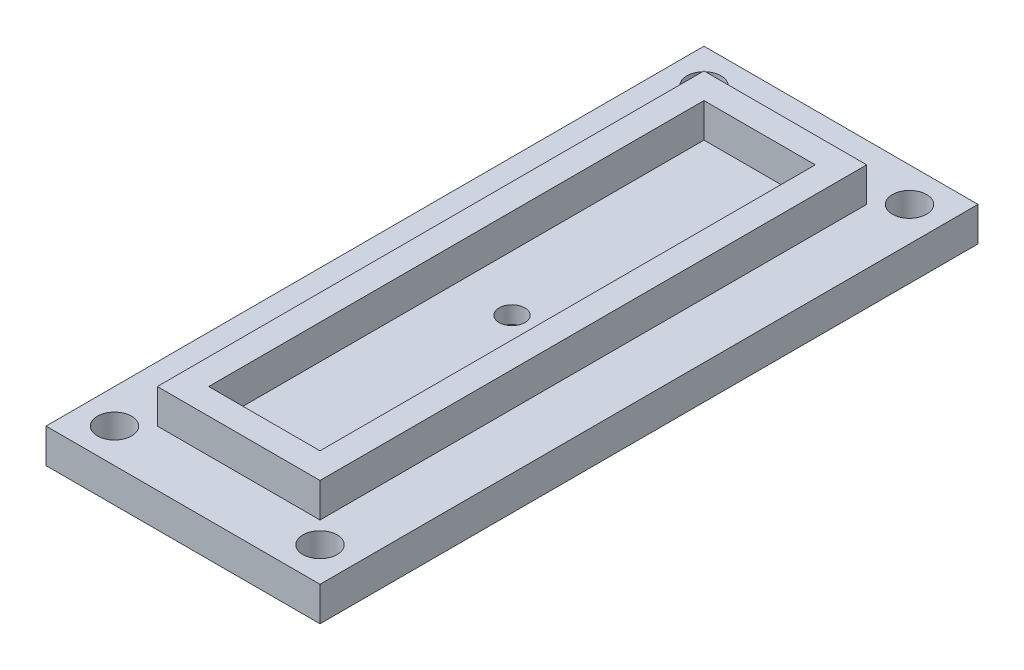
ISO-10303-21;
HEADER;
FILE_DESCRIPTION(('STEP AP214'),'2;1');
FILE_NAME('part.step','',(''),(''),'','','');
FILE_SCHEMA(('AUTOMOTIVE_DESIGN { 1 0 10303 214 1 1 1 1 }'));
ENDSEC;
DATA;
#1=APPLICATION_CONTEXT('core data for automotive mechanical design processes');
#2=APPLICATION_PROTOCOL_DEFINITION('international standard','automotive_design',2000,#1);
#3=PRODUCT_CONTEXT('',#1,'mechanical');
#4=PRODUCT('Part','Part','',(#3));
#5=PRODUCT_RELATED_PRODUCT_CATEGORY('part','',(#4));
#6=PRODUCT_DEFINITION_FORMATION('','',#4);
#7=PRODUCT_DEFINITION_CONTEXT('part definition',#1,'design');
#8=PRODUCT_DEFINITION('design','',#6,#7);
#9=PRODUCT_DEFINITION_SHAPE('','',#8);
#10=(LENGTH_UNIT() NAMED_UNIT(*) SI_UNIT(.MILLI.,.METRE.));
#11=(NAMED_UNIT(*) PLANE_ANGLE_UNIT() SI_UNIT($,.RADIAN.));
#12=(NAMED_UNIT(*) SI_UNIT($,.STERADIAN.) SOLID_ANGLE_UNIT());
#13=UNCERTAINTY_MEASURE_WITH_UNIT(LENGTH_MEASURE(1.E-05),#10,'distance_accuracy_value','');
#14=(GEOMETRIC_REPRESENTATION_CONTEXT(3) GLOBAL_UNCERTAINTY_ASSIGNED_CONTEXT((#13)) GLOBAL_UNIT_ASSIGNED_CONTEXT((#10,
#11,#12)) REPRESENTATION_CONTEXT('',''));
#15=CARTESIAN_POINT('',(0.,0.,0.));
#16=DIRECTION('',(0.,0.,1.));
#17=DIRECTION('',(1.,0.,0.));
#18=AXIS2_PLACEMENT_3D('',#15,#16,#17);
#19=CARTESIAN_POINT('',(0.,0.,0.));
#20=DIRECTION('',(0.,1.,0.));
#21=DIRECTION('',(0.,0.,1.));
#22=AXIS2_PLACEMENT_3D('',#19,#20,#21);
#23=CYLINDRICAL_SURFACE('',#22,0.75);
#24=CARTESIAN_POINT('',(0.,2.,0.));
#25=DIRECTION('',(0.,-1.,0.));
#26=DIRECTION('',(0.,0.,-1.));
#27=AXIS2_PLACEMENT_3D('',#24,#25,#26);
#28=CIRCLE('',#27,0.75);
#29=CARTESIAN_POINT('',(0.,2.,-0.75));
#30=VERTEX_POINT('',#29);
#31=EDGE_CURVE('E543',#30,#30,#28,.T.);
#32=ORIENTED_EDGE('',*,*,#31,.F.);
#33=EDGE_LOOP('',(#32));
#34=FACE_BOUND('',#33,.T.);
#35=CARTESIAN_POINT('',(0.,1.,0.));
#36=DIRECTION('',(0.,-1.,0.));
#37=DIRECTION('',(0.,0.,-1.));
#38=AXIS2_PLACEMENT_3D('',#35,#36,#37);
#39=CIRCLE('',#38,0.75);
#40=CARTESIAN_POINT('',(0.,1.,-0.75));
#41=VERTEX_POINT('',#40);
#42=EDGE_CURVE('E85',#41,#41,#39,.F.);
#43=ORIENTED_EDGE('',*,*,#42,.F.);
#44=EDGE_LOOP('',(#43));
#45=FACE_BOUND('',#44,.T.);
#46=ADVANCED_FACE('F81',(#34,#45),#23,.F.);
#47=CARTESIAN_POINT('',(0.,2.,0.));
#48=DIRECTION('',(0.,-1.,0.));
#49=DIRECTION('',(0.,0.,-1.));
#50=AXIS2_PLACEMENT_3D('',#47,#48,#49);
#51=PLANE('',#50);
#52=CARTESIAN_POINT('',(6.00000000000001,2.,-17.21));
#53=DIRECTION('',(0.,-1.,0.));
#54=DIRECTION('',(0.,0.,-1.));
#55=AXIS2_PLACEMENT_3D('',#52,#53,#54);
#56=CIRCLE('',#55,0.999999999999998);
#57=CARTESIAN_POINT('',(6.00000000000001,2.,-18.21));
#58=VERTEX_POINT('',#57);
#59=EDGE_CURVE('E282',#58,#58,#56,.F.);
#60=ORIENTED_EDGE('',*,*,#59,.F.);
#61=EDGE_LOOP('',(#60));
#62=FACE_BOUND('',#61,.T.);
#63=CARTESIAN_POINT('',(5.99999999999999,2.,17.21));
#64=DIRECTION('',(0.,-1.,0.));
#65=DIRECTION('',(0.,0.,-1.));
#66=AXIS2_PLACEMENT_3D('',#63,#64,#65);
#67=CIRCLE('',#66,0.999999999999998);
#68=CARTESIAN_POINT('',(5.99999999999999,2.,16.21));
#69=VERTEX_POINT('',#68);
#70=EDGE_CURVE('E288',#69,#69,#67,.T.);
#71=ORIENTED_EDGE('',*,*,#70,.T.);
#72=EDGE_LOOP('',(#71));
#73=FACE_BOUND('',#72,.T.);
#74=DIRECTION('',(0.,0.,-1.));
#75=VECTOR('',#74,1.);
#76=CARTESIAN_POINT('',(7.99999999999999,2.,19.21));
#77=LINE('',#76,#75);
#78=CARTESIAN_POINT('',(7.99999999999999,2.,19.21));
#79=VERTEX_POINT('',#78);
#80=CARTESIAN_POINT('',(7.99999999999999,2.,-19.21));
#81=VERTEX_POINT('',#80);
#82=EDGE_CURVE('E355',#79,#81,#77,.T.);
#83=ORIENTED_EDGE('',*,*,#82,.T.);
#84=DIRECTION('',(-1.,0.,0.));
#85=VECTOR('',#84,1.);
#86=CARTESIAN_POINT('',(-8.,2.,-19.21));
#87=LINE('',#86,#85);
#88=CARTESIAN_POINT('',(-8.,2.,-19.21));
#89=VERTEX_POINT('',#88);
#90=EDGE_CURVE('E358',#81,#89,#87,.T.);
#91=ORIENTED_EDGE('',*,*,#90,.T.);
#92=DIRECTION('',(0.,0.,1.));
#93=VECTOR('',#92,1.);
#94=CARTESIAN_POINT('',(-8.,2.,19.21));
#95=LINE('',#94,#93);
#96=CARTESIAN_POINT('',(-8.,2.,19.21));
#97=VERTEX_POINT('',#96);
#98=EDGE_CURVE('E361',#89,#97,#95,.T.);
#99=ORIENTED_EDGE('',*,*,#98,.T.);
#100=DIRECTION('',(1.,0.,0.));
#101=VECTOR('',#100,1.);
#102=CARTESIAN_POINT('',(-8.,2.,19.21));
#103=LINE('',#102,#101);
#104=EDGE_CURVE('E363',#97,#79,#103,.T.);
#105=ORIENTED_EDGE('',*,*,#104,.T.);
#106=EDGE_LOOP('',(#83,#91,#99,#105));
#107=FACE_BOUND('',#106,.T.);
#108=DIRECTION('',(0.,0.,-1.));
#109=VECTOR('',#108,1.);
#110=CARTESIAN_POINT('',(4.75,2.,0.));
#111=LINE('',#110,#109);
#112=CARTESIAN_POINT('',(4.75,2.,15.96));
#113=VERTEX_POINT('',#112);
#114=CARTESIAN_POINT('',(4.75,2.,-15.96));
#115=VERTEX_POINT('',#114);
#116=EDGE_CURVE('E321',#113,#115,#111,.T.);
#117=ORIENTED_EDGE('',*,*,#116,.F.);
#118=DIRECTION('',(1.,0.,0.));
#119=VECTOR('',#118,1.);
#120=CARTESIAN_POINT('',(0.,2.,15.96));
#121=LINE('',#120,#119);
#122=CARTESIAN_POINT('',(-4.75,2.,15.96));
#123=VERTEX_POINT('',#122);
#124=EDGE_CURVE('E326',#123,#113,#121,.T.);
#125=ORIENTED_EDGE('',*,*,#124,.F.);
#126=DIRECTION('',(0.,0.,1.));
#127=VECTOR('',#126,1.);
#128=CARTESIAN_POINT('',(-4.75,2.,0.));
#129=LINE('',#128,#127);
#130=CARTESIAN_POINT('',(-4.75,2.,-15.96));
#131=VERTEX_POINT('',#130);
#132=EDGE_CURVE('E338',#131,#123,#129,.T.);
#133=ORIENTED_EDGE('',*,*,#132,.F.);
#134=DIRECTION('',(-1.,0.,0.));
#135=VECTOR('',#134,1.);
#136=CARTESIAN_POINT('',(0.,2.,-15.96));
#137=LINE('',#136,#135);
#138=EDGE_CURVE('E335',#115,#131,#137,.T.);
#139=ORIENTED_EDGE('',*,*,#138,.F.);
#140=EDGE_LOOP('',(#117,#125,#133,#139));
#141=FACE_BOUND('',#140,.T.);
#142=CARTESIAN_POINT('',(-6.00000000000001,2.,-17.21));
#143=DIRECTION('',(0.,-1.,0.));
#144=DIRECTION('',(0.,0.,-1.));
#145=AXIS2_PLACEMENT_3D('',#142,#143,#144);
#146=CIRCLE('',#145,0.999999999999998);
#147=CARTESIAN_POINT('',(-6.00000000000001,2.,-18.21));
#148=VERTEX_POINT('',#147);
#149=EDGE_CURVE('E276',#148,#148,#146,.T.);
#150=ORIENTED_EDGE('',*,*,#149,.T.);
#151=EDGE_LOOP('',(#150));
#152=FACE_BOUND('',#151,.T.);
#153=CARTESIAN_POINT('',(-5.99999999999999,2.,17.21));
#154=DIRECTION('',(0.,-1.,0.));
#155=DIRECTION('',(0.,0.,-1.));
#156=AXIS2_PLACEMENT_3D('',#153,#154,#155);
#157=CIRCLE('',#156,0.999999999999998);
#158=CARTESIAN_POINT('',(-5.99999999999999,2.,16.21));
#159=VERTEX_POINT('',#158);
#160=EDGE_CURVE('E270',#159,#159,#157,.F.);
#161=ORIENTED_EDGE('',*,*,#160,.F.);
#162=EDGE_LOOP('',(#161));
#163=FACE_BOUND('',#162,.T.);
#164=ADVANCED_FACE('F431',(#62,#73,#107,#141,#152,#163),#51,.F.);
#165=CARTESIAN_POINT('',(0.,0.,0.));
#166=DIRECTION('',(0.,-1.,0.));
#167=DIRECTION('',(0.,0.,-1.));
#168=AXIS2_PLACEMENT_3D('',#165,#166,#167);
#169=PLANE('',#168);
#170=DIRECTION('',(0.,0.,1.));
#171=VECTOR('',#170,1.);
#172=CARTESIAN_POINT('',(4.75,0.,0.));
#173=LINE('',#172,#171);
#174=CARTESIAN_POINT('',(4.75,0.,-15.96));
#175=VERTEX_POINT('',#174);
#176=CARTESIAN_POINT('',(4.75,0.,15.96));
#177=VERTEX_POINT('',#176);
#178=EDGE_CURVE('E12',#175,#177,#173,.T.);
#179=ORIENTED_EDGE('',*,*,#178,.F.);
#180=DIRECTION('',(1.,0.,0.));
#181=VECTOR('',#180,1.);
#182=CARTESIAN_POINT('',(0.,0.,-15.96));
#183=LINE('',#182,#181);
#184=CARTESIAN_POINT('',(-4.75,0.,-15.96));
#185=VERTEX_POINT('',#184);
#186=EDGE_CURVE('E393',#185,#175,#183,.T.);
#187=ORIENTED_EDGE('',*,*,#186,.F.);
#188=DIRECTION('',(0.,0.,-1.));
#189=VECTOR('',#188,1.);
#190=CARTESIAN_POINT('',(-4.75,0.,0.));
#191=LINE('',#190,#189);
#192=CARTESIAN_POINT('',(-4.75,0.,15.96));
#193=VERTEX_POINT('',#192);
#194=EDGE_CURVE('E395',#193,#185,#191,.T.);
#195=ORIENTED_EDGE('',*,*,#194,.F.);
#196=DIRECTION('',(-1.,0.,0.));
#197=VECTOR('',#196,1.);
#198=CARTESIAN_POINT('',(0.,0.,15.96));
#199=LINE('',#198,#197);
#200=EDGE_CURVE('E90',#177,#193,#199,.T.);
#201=ORIENTED_EDGE('',*,*,#200,.F.);
#202=EDGE_LOOP('',(#179,#187,#195,#201));
#203=FACE_BOUND('',#202,.T.);
#204=CARTESIAN_POINT('',(6.00000000000001,0.,-17.21));
#205=DIRECTION('',(0.,1.,0.));
#206=DIRECTION('',(0.,0.,1.));
#207=AXIS2_PLACEMENT_3D('',#204,#205,#206);
#208=CIRCLE('',#207,0.999999999999998);
#209=CARTESIAN_POINT('',(6.00000000000001,0.,-16.21));
#210=VERTEX_POINT('',#209);
#211=EDGE_CURVE('E279',#210,#210,#208,.T.);
#212=ORIENTED_EDGE('',*,*,#211,.T.);
#213=EDGE_LOOP('',(#212));
#214=FACE_BOUND('',#213,.T.);
#215=CARTESIAN_POINT('',(5.99999999999999,0.,17.21));
#216=DIRECTION('',(0.,-1.,0.));
#217=DIRECTION('',(0.,0.,-1.));
#218=AXIS2_PLACEMENT_3D('',#215,#216,#217);
#219=CIRCLE('',#218,0.999999999999998);
#220=CARTESIAN_POINT('',(5.99999999999999,0.,16.21));
#221=VERTEX_POINT('',#220);
#222=EDGE_CURVE('E285',#221,#221,#219,.T.);
#223=ORIENTED_EDGE('',*,*,#222,.F.);
#224=EDGE_LOOP('',(#223));
#225=FACE_BOUND('',#224,.T.);
#226=DIRECTION('',(0.,0.,-1.));
#227=VECTOR('',#226,1.);
#228=CARTESIAN_POINT('',(7.99999999999999,0.,19.21));
#229=LINE('',#228,#227);
#230=CARTESIAN_POINT('',(7.99999999999999,0.,19.21));
#231=VERTEX_POINT('',#230);
#232=CARTESIAN_POINT('',(7.99999999999999,0.,-19.21));
#233=VERTEX_POINT('',#232);
#234=EDGE_CURVE('E354',#231,#233,#229,.T.);
#235=ORIENTED_EDGE('',*,*,#234,.F.);
#236=DIRECTION('',(1.,0.,0.));
#237=VECTOR('',#236,1.);
#238=CARTESIAN_POINT('',(-8.,0.,19.21));
#239=LINE('',#238,#237);
#240=CARTESIAN_POINT('',(-8.,0.,19.21));
#241=VERTEX_POINT('',#240);
#242=EDGE_CURVE('E359',#241,#231,#239,.T.);
#243=ORIENTED_EDGE('',*,*,#242,.F.);
#244=DIRECTION('',(0.,0.,1.));
#245=VECTOR('',#244,1.);
#246=CARTESIAN_POINT('',(-8.,0.,19.21));
#247=LINE('',#246,#245);
#248=CARTESIAN_POINT('',(-8.,0.,-19.21));
#249=VERTEX_POINT('',#248);
#250=EDGE_CURVE('E370',#249,#241,#247,.T.);
#251=ORIENTED_EDGE('',*,*,#250,.F.);
#252=DIRECTION('',(-1.,0.,0.));
#253=VECTOR('',#252,1.);
#254=CARTESIAN_POINT('',(-8.,0.,-19.21));
#255=LINE('',#254,#253);
#256=EDGE_CURVE('E368',#233,#249,#255,.T.);
#257=ORIENTED_EDGE('',*,*,#256,.F.);
#258=EDGE_LOOP('',(#235,#243,#251,#257));
#259=FACE_BOUND('',#258,.T.);
#260=CARTESIAN_POINT('',(-6.00000000000001,0.,-17.21));
#261=DIRECTION('',(0.,-1.,0.));
#262=DIRECTION('',(0.,0.,1.));
#263=AXIS2_PLACEMENT_3D('',#260,#261,#262);
#264=CIRCLE('',#263,0.999999999999998);
#265=CARTESIAN_POINT('',(-6.00000000000001,0.,-16.21));
#266=VERTEX_POINT('',#265);
#267=EDGE_CURVE('E273',#266,#266,#264,.T.);
#268=ORIENTED_EDGE('',*,*,#267,.F.);
#269=EDGE_LOOP('',(#268));
#270=FACE_BOUND('',#269,.T.);
#271=CARTESIAN_POINT('',(-5.99999999999999,0.,17.21));
#272=DIRECTION('',(0.,1.,0.));
#273=DIRECTION('',(0.,0.,-1.));
#274=AXIS2_PLACEMENT_3D('',#271,#272,#273);
#275=CIRCLE('',#274,0.999999999999998);
#276=CARTESIAN_POINT('',(-5.99999999999999,0.,16.21));
#277=VERTEX_POINT('',#276);
#278=EDGE_CURVE('E263',#277,#277,#275,.T.);
#279=ORIENTED_EDGE('',*,*,#278,.T.);
#280=EDGE_LOOP('',(#279));
#281=FACE_BOUND('',#280,.T.);
#282=ADVANCED_FACE('F410',(#203,#214,#225,#259,#270,#281),#169,.T.);
#283=CARTESIAN_POINT('',(7.99999999999999,2.,19.21));
#284=DIRECTION('',(-1.,0.,0.));
#285=DIRECTION('',(0.,0.,1.));
#286=AXIS2_PLACEMENT_3D('',#283,#284,#285);
#287=PLANE('',#286);
#288=ORIENTED_EDGE('',*,*,#234,.T.);
#289=DIRECTION('',(0.,-1.,0.));
#290=VECTOR('',#289,1.);
#291=CARTESIAN_POINT('',(7.99999999999999,2.,-19.21));
#292=LINE('',#291,#290);
#293=EDGE_CURVE('E381',#81,#233,#292,.T.);
#294=ORIENTED_EDGE('',*,*,#293,.F.);
#295=ORIENTED_EDGE('',*,*,#82,.F.);
#296=DIRECTION('',(0.,-1.,0.));
#297=VECTOR('',#296,1.);
#298=CARTESIAN_POINT('',(7.99999999999999,2.,19.21));
#299=LINE('',#298,#297);
#300=EDGE_CURVE('E365',#79,#231,#299,.T.);
#301=ORIENTED_EDGE('',*,*,#300,.T.);
#302=EDGE_LOOP('',(#288,#294,#295,#301));
#303=FACE_BOUND('',#302,.T.);
#304=ADVANCED_FACE('F83',(#303),#287,.F.);
#305=CARTESIAN_POINT('',(-8.,2.,-19.21));
#306=DIRECTION('',(0.,0.,1.));
#307=DIRECTION('',(1.,0.,0.));
#308=AXIS2_PLACEMENT_3D('',#305,#306,#307);
#309=PLANE('',#308);
#310=ORIENTED_EDGE('',*,*,#256,.T.);
#311=DIRECTION('',(0.,-1.,0.));
#312=VECTOR('',#311,1.);
#313=CARTESIAN_POINT('',(-8.,2.,-19.21));
#314=LINE('',#313,#312);
#315=EDGE_CURVE('E378',#89,#249,#314,.T.);
#316=ORIENTED_EDGE('',*,*,#315,.F.);
#317=ORIENTED_EDGE('',*,*,#90,.F.);
#318=ORIENTED_EDGE('',*,*,#293,.T.);
#319=EDGE_LOOP('',(#310,#316,#317,#318));
#320=FACE_BOUND('',#319,.T.);
#321=ADVANCED_FACE('F470',(#320),#309,.F.);
#322=CARTESIAN_POINT('',(-8.,2.,19.21));
#323=DIRECTION('',(1.,0.,0.));
#324=DIRECTION('',(0.,0.,-1.));
#325=AXIS2_PLACEMENT_3D('',#322,#323,#324);
#326=PLANE('',#325);
#327=ORIENTED_EDGE('',*,*,#250,.T.);
#328=DIRECTION('',(0.,-1.,0.));
#329=VECTOR('',#328,1.);
#330=CARTESIAN_POINT('',(-8.,2.,19.21));
#331=LINE('',#330,#329);
#332=EDGE_CURVE('E375',#97,#241,#331,.T.);
#333=ORIENTED_EDGE('',*,*,#332,.F.);
#334=ORIENTED_EDGE('',*,*,#98,.F.);
#335=ORIENTED_EDGE('',*,*,#315,.T.);
#336=EDGE_LOOP('',(#327,#333,#334,#335));
#337=FACE_BOUND('',#336,.T.);
#338=ADVANCED_FACE('F475',(#337),#326,.F.);
#339=CARTESIAN_POINT('',(-8.,2.,19.21));
#340=DIRECTION('',(0.,0.,-1.));
#341=DIRECTION('',(-1.,0.,0.));
#342=AXIS2_PLACEMENT_3D('',#339,#340,#341);
#343=PLANE('',#342);
#344=ORIENTED_EDGE('',*,*,#242,.T.);
#345=ORIENTED_EDGE('',*,*,#300,.F.);
#346=ORIENTED_EDGE('',*,*,#104,.F.);
#347=ORIENTED_EDGE('',*,*,#332,.T.);
#348=EDGE_LOOP('',(#344,#345,#346,#347));
#349=FACE_BOUND('',#348,.T.);
#350=ADVANCED_FACE('F492',(#349),#343,.F.);
#351=CARTESIAN_POINT('',(0.,4.,0.));
#352=DIRECTION('',(0.,1.,0.));
#353=DIRECTION('',(0.,0.,1.));
#354=AXIS2_PLACEMENT_3D('',#351,#352,#353);
#355=PLANE('',#354);
#356=DIRECTION('',(0.,0.,-1.));
#357=VECTOR('',#356,1.);
#358=CARTESIAN_POINT('',(4.75,4.,0.));
#359=LINE('',#358,#357);
#360=CARTESIAN_POINT('',(4.75,4.,15.96));
#361=VERTEX_POINT('',#360);
#362=CARTESIAN_POINT('',(4.75,4.,-15.96));
#363=VERTEX_POINT('',#362);
#364=EDGE_CURVE('E322',#361,#363,#359,.T.);
#365=ORIENTED_EDGE('',*,*,#364,.T.);
#366=DIRECTION('',(-1.,0.,0.));
#367=VECTOR('',#366,1.);
#368=CARTESIAN_POINT('',(0.,4.,-15.96));
#369=LINE('',#368,#367);
#370=CARTESIAN_POINT('',(-4.75,4.,-15.96));
#371=VERTEX_POINT('',#370);
#372=EDGE_CURVE('E325',#363,#371,#369,.T.);
#373=ORIENTED_EDGE('',*,*,#372,.T.);
#374=DIRECTION('',(0.,0.,1.));
#375=VECTOR('',#374,1.);
#376=CARTESIAN_POINT('',(-4.75,4.,0.));
#377=LINE('',#376,#375);
#378=CARTESIAN_POINT('',(-4.75,4.,15.96));
#379=VERTEX_POINT('',#378);
#380=EDGE_CURVE('E328',#371,#379,#377,.T.);
#381=ORIENTED_EDGE('',*,*,#380,.T.);
#382=DIRECTION('',(1.,0.,0.));
#383=VECTOR('',#382,1.);
#384=CARTESIAN_POINT('',(0.,4.,15.96));
#385=LINE('',#384,#383);
#386=EDGE_CURVE('E330',#379,#361,#385,.T.);
#387=ORIENTED_EDGE('',*,*,#386,.T.);
#388=EDGE_LOOP('',(#365,#373,#381,#387));
#389=FACE_BOUND('',#388,.T.);
#390=DIRECTION('',(-1.,0.,0.));
#391=VECTOR('',#390,1.);
#392=CARTESIAN_POINT('',(0.,4.,-14.46));
#393=LINE('',#392,#391);
#394=CARTESIAN_POINT('',(3.25,4.,-14.46));
#395=VERTEX_POINT('',#394);
#396=CARTESIAN_POINT('',(-3.25,4.,-14.46));
#397=VERTEX_POINT('',#396);
#398=EDGE_CURVE('E294',#395,#397,#393,.T.);
#399=ORIENTED_EDGE('',*,*,#398,.F.);
#400=DIRECTION('',(0.,0.,-1.));
#401=VECTOR('',#400,1.);
#402=CARTESIAN_POINT('',(3.25,4.,0.));
#403=LINE('',#402,#401);
#404=CARTESIAN_POINT('',(3.25,4.,14.46));
#405=VERTEX_POINT('',#404);
#406=EDGE_CURVE('E292',#405,#395,#403,.T.);
#407=ORIENTED_EDGE('',*,*,#406,.F.);
#408=DIRECTION('',(1.,0.,0.));
#409=VECTOR('',#408,1.);
#410=CARTESIAN_POINT('',(0.,4.,14.46));
#411=LINE('',#410,#409);
#412=CARTESIAN_POINT('',(-3.25,4.,14.46));
#413=VERTEX_POINT('',#412);
#414=EDGE_CURVE('E300',#413,#405,#411,.T.);
#415=ORIENTED_EDGE('',*,*,#414,.F.);
#416=DIRECTION('',(0.,0.,1.));
#417=VECTOR('',#416,1.);
#418=CARTESIAN_POINT('',(-3.25,4.,0.));
#419=LINE('',#418,#417);
#420=EDGE_CURVE('E297',#397,#413,#419,.T.);
#421=ORIENTED_EDGE('',*,*,#420,.F.);
#422=EDGE_LOOP('',(#399,#407,#415,#421));
#423=FACE_BOUND('',#422,.T.);
#424=ADVANCED_FACE('F499',(#389,#423),#355,.T.);
#425=CARTESIAN_POINT('',(4.75,4.,0.));
#426=DIRECTION('',(-1.,0.,0.));
#427=DIRECTION('',(0.,0.,1.));
#428=AXIS2_PLACEMENT_3D('',#425,#426,#427);
#429=PLANE('',#428);
#430=ORIENTED_EDGE('',*,*,#116,.T.);
#431=DIRECTION('',(0.,-1.,0.));
#432=VECTOR('',#431,1.);
#433=CARTESIAN_POINT('',(4.75,4.,-15.96));
#434=LINE('',#433,#432);
#435=EDGE_CURVE('E351',#363,#115,#434,.T.);
#436=ORIENTED_EDGE('',*,*,#435,.F.);
#437=ORIENTED_EDGE('',*,*,#364,.F.);
#438=DIRECTION('',(0.,-1.,0.));
#439=VECTOR('',#438,1.);
#440=CARTESIAN_POINT('',(4.75,4.,15.96));
#441=LINE('',#440,#439);
#442=EDGE_CURVE('E332',#361,#113,#441,.T.);
#443=ORIENTED_EDGE('',*,*,#442,.T.);
#444=EDGE_LOOP('',(#430,#436,#437,#443));
#445=FACE_BOUND('',#444,.T.);
#446=ADVANCED_FACE('F503',(#445),#429,.F.);
#447=CARTESIAN_POINT('',(0.,4.,-15.96));
#448=DIRECTION('',(0.,0.,1.));
#449=DIRECTION('',(1.,0.,0.));
#450=AXIS2_PLACEMENT_3D('',#447,#448,#449);
#451=PLANE('',#450);
#452=ORIENTED_EDGE('',*,*,#138,.T.);
#453=DIRECTION('',(0.,-1.,0.));
#454=VECTOR('',#453,1.);
#455=CARTESIAN_POINT('',(-4.75,4.,-15.96));
#456=LINE('',#455,#454);
#457=EDGE_CURVE('E348',#371,#131,#456,.T.);
#458=ORIENTED_EDGE('',*,*,#457,.F.);
#459=ORIENTED_EDGE('',*,*,#372,.F.);
#460=ORIENTED_EDGE('',*,*,#435,.T.);
#461=EDGE_LOOP('',(#452,#458,#459,#460));
#462=FACE_BOUND('',#461,.T.);
#463=ADVANCED_FACE('F509',(#462),#451,.F.);
#464=CARTESIAN_POINT('',(-4.75,4.,0.));
#465=DIRECTION('',(1.,0.,0.));
#466=DIRECTION('',(0.,0.,-1.));
#467=AXIS2_PLACEMENT_3D('',#464,#465,#466);
#468=PLANE('',#467);
#469=ORIENTED_EDGE('',*,*,#132,.T.);
#470=DIRECTION('',(0.,-1.,0.));
#471=VECTOR('',#470,1.);
#472=CARTESIAN_POINT('',(-4.75,4.,15.96));
#473=LINE('',#472,#471);
#474=EDGE_CURVE('E345',#379,#123,#473,.T.);
#475=ORIENTED_EDGE('',*,*,#474,.F.);
#476=ORIENTED_EDGE('',*,*,#380,.F.);
#477=ORIENTED_EDGE('',*,*,#457,.T.);
#478=EDGE_LOOP('',(#469,#475,#476,#477));
#479=FACE_BOUND('',#478,.T.);
#480=ADVANCED_FACE('F520',(#479),#468,.F.);
#481=CARTESIAN_POINT('',(0.,4.,15.96));
#482=DIRECTION('',(0.,0.,-1.));
#483=DIRECTION('',(-1.,0.,0.));
#484=AXIS2_PLACEMENT_3D('',#481,#482,#483);
#485=PLANE('',#484);
#486=ORIENTED_EDGE('',*,*,#124,.T.);
#487=ORIENTED_EDGE('',*,*,#442,.F.);
#488=ORIENTED_EDGE('',*,*,#386,.F.);
#489=ORIENTED_EDGE('',*,*,#474,.T.);
#490=EDGE_LOOP('',(#486,#487,#488,#489));
#491=FACE_BOUND('',#490,.T.);
#492=ADVANCED_FACE('F517',(#491),#485,.F.);
#493=CARTESIAN_POINT('',(3.25,4.,0.));
#494=DIRECTION('',(-1.,0.,0.));
#495=DIRECTION('',(0.,0.,1.));
#496=AXIS2_PLACEMENT_3D('',#493,#494,#495);
#497=PLANE('',#496);
#498=DIRECTION('',(0.,0.,-1.));
#499=VECTOR('',#498,1.);
#500=CARTESIAN_POINT('',(3.25,2.,0.));
#501=LINE('',#500,#499);
#502=CARTESIAN_POINT('',(3.25,2.,14.46));
#503=VERTEX_POINT('',#502);
#504=CARTESIAN_POINT('',(3.25,2.,-14.46));
#505=VERTEX_POINT('',#504);
#506=EDGE_CURVE('E291',#503,#505,#501,.T.);
#507=ORIENTED_EDGE('',*,*,#506,.F.);
#508=DIRECTION('',(0.,-1.,0.));
#509=VECTOR('',#508,1.);
#510=CARTESIAN_POINT('',(3.25,4.,14.46));
#511=LINE('',#510,#509);
#512=EDGE_CURVE('E302',#405,#503,#511,.T.);
#513=ORIENTED_EDGE('',*,*,#512,.F.);
#514=ORIENTED_EDGE('',*,*,#406,.T.);
#515=DIRECTION('',(0.,-1.,0.));
#516=VECTOR('',#515,1.);
#517=CARTESIAN_POINT('',(3.25,4.,-14.46));
#518=LINE('',#517,#516);
#519=EDGE_CURVE('E318',#395,#505,#518,.T.);
#520=ORIENTED_EDGE('',*,*,#519,.T.);
#521=EDGE_LOOP('',(#507,#513,#514,#520));
#522=FACE_BOUND('',#521,.T.);
#523=ADVANCED_FACE('F515',(#522),#497,.T.);
#524=CARTESIAN_POINT('',(0.,4.,-14.46));
#525=DIRECTION('',(0.,0.,1.));
#526=DIRECTION('',(1.,0.,0.));
#527=AXIS2_PLACEMENT_3D('',#524,#525,#526);
#528=PLANE('',#527);
#529=DIRECTION('',(-1.,0.,0.));
#530=VECTOR('',#529,1.);
#531=CARTESIAN_POINT('',(0.,2.,-14.46));
#532=LINE('',#531,#530);
#533=CARTESIAN_POINT('',(-3.25,2.,-14.46));
#534=VERTEX_POINT('',#533);
#535=EDGE_CURVE('E305',#505,#534,#532,.T.);
#536=ORIENTED_EDGE('',*,*,#535,.F.);
#537=ORIENTED_EDGE('',*,*,#519,.F.);
#538=ORIENTED_EDGE('',*,*,#398,.T.);
#539=DIRECTION('',(0.,-1.,0.));
#540=VECTOR('',#539,1.);
#541=CARTESIAN_POINT('',(-3.25,4.,-14.46));
#542=LINE('',#541,#540);
#543=EDGE_CURVE('E316',#397,#534,#542,.T.);
#544=ORIENTED_EDGE('',*,*,#543,.T.);
#545=EDGE_LOOP('',(#536,#537,#538,#544));
#546=FACE_BOUND('',#545,.T.);
#547=ADVANCED_FACE('F554',(#546),#528,.T.);
#548=CARTESIAN_POINT('',(-3.25,4.,0.));
#549=DIRECTION('',(1.,0.,0.));
#550=DIRECTION('',(0.,0.,-1.));
#551=AXIS2_PLACEMENT_3D('',#548,#549,#550);
#552=PLANE('',#551);
#553=DIRECTION('',(0.,0.,1.));
#554=VECTOR('',#553,1.);
#555=CARTESIAN_POINT('',(-3.25,2.,0.));
#556=LINE('',#555,#554);
#557=CARTESIAN_POINT('',(-3.25,2.,14.46));
#558=VERTEX_POINT('',#557);
#559=EDGE_CURVE('E308',#534,#558,#556,.T.);
#560=ORIENTED_EDGE('',*,*,#559,.F.);
#561=ORIENTED_EDGE('',*,*,#543,.F.);
#562=ORIENTED_EDGE('',*,*,#420,.T.);
#563=DIRECTION('',(0.,-1.,0.));
#564=VECTOR('',#563,1.);
#565=CARTESIAN_POINT('',(-3.25,4.,14.46));
#566=LINE('',#565,#564);
#567=EDGE_CURVE('E314',#413,#558,#566,.T.);
#568=ORIENTED_EDGE('',*,*,#567,.T.);
#569=EDGE_LOOP('',(#560,#561,#562,#568));
#570=FACE_BOUND('',#569,.T.);
#571=ADVANCED_FACE('F538',(#570),#552,.T.);
#572=CARTESIAN_POINT('',(0.,4.,14.46));
#573=DIRECTION('',(0.,0.,-1.));
#574=DIRECTION('',(-1.,0.,0.));
#575=AXIS2_PLACEMENT_3D('',#572,#573,#574);
#576=PLANE('',#575);
#577=DIRECTION('',(1.,0.,0.));
#578=VECTOR('',#577,1.);
#579=CARTESIAN_POINT('',(0.,2.,14.46));
#580=LINE('',#579,#578);
#581=EDGE_CURVE('E295',#558,#503,#580,.T.);
#582=ORIENTED_EDGE('',*,*,#581,.F.);
#583=ORIENTED_EDGE('',*,*,#567,.F.);
#584=ORIENTED_EDGE('',*,*,#414,.T.);
#585=ORIENTED_EDGE('',*,*,#512,.T.);
#586=EDGE_LOOP('',(#582,#583,#584,#585));
#587=FACE_BOUND('',#586,.T.);
#588=ADVANCED_FACE('F529',(#587),#576,.T.);
#589=ORIENTED_EDGE('',*,*,#31,.T.);
#590=EDGE_LOOP('',(#589));
#591=FACE_BOUND('',#590,.T.);
#592=ORIENTED_EDGE('',*,*,#581,.T.);
#593=ORIENTED_EDGE('',*,*,#506,.T.);
#594=ORIENTED_EDGE('',*,*,#535,.T.);
#595=ORIENTED_EDGE('',*,*,#559,.T.);
#596=EDGE_LOOP('',(#592,#593,#594,#595));
#597=FACE_BOUND('',#596,.T.);
#598=ADVANCED_FACE('F439',(#591,#597),#51,.F.);
#599=CARTESIAN_POINT('',(5.99999999999999,4.,17.21));
#600=DIRECTION('',(0.,-1.,0.));
#601=DIRECTION('',(0.,0.,-1.));
#602=AXIS2_PLACEMENT_3D('',#599,#600,#601);
#603=CYLINDRICAL_SURFACE('',#602,0.999999999999998);
#604=ORIENTED_EDGE('',*,*,#222,.T.);
#605=EDGE_LOOP('',(#604));
#606=FACE_BOUND('',#605,.T.);
#607=ORIENTED_EDGE('',*,*,#70,.F.);
#608=EDGE_LOOP('',(#607));
#609=FACE_BOUND('',#608,.T.);
#610=ADVANCED_FACE('F528',(#606,#609),#603,.F.);
#611=CARTESIAN_POINT('',(6.00000000000001,4.,-17.21));
#612=DIRECTION('',(0.,-1.,0.));
#613=DIRECTION('',(0.,0.,-1.));
#614=AXIS2_PLACEMENT_3D('',#611,#612,#613);
#615=CYLINDRICAL_SURFACE('',#614,0.999999999999998);
#616=ORIENTED_EDGE('',*,*,#211,.F.);
#617=EDGE_LOOP('',(#616));
#618=FACE_BOUND('',#617,.T.);
#619=ORIENTED_EDGE('',*,*,#59,.T.);
#620=EDGE_LOOP('',(#619));
#621=FACE_BOUND('',#620,.T.);
#622=ADVANCED_FACE('F535',(#618,#621),#615,.F.);
#623=CARTESIAN_POINT('',(-6.00000000000001,4.,-17.21));
#624=DIRECTION('',(0.,-1.,0.));
#625=DIRECTION('',(0.,0.,-1.));
#626=AXIS2_PLACEMENT_3D('',#623,#624,#625);
#627=CYLINDRICAL_SURFACE('',#626,0.999999999999998);
#628=ORIENTED_EDGE('',*,*,#267,.T.);
#629=EDGE_LOOP('',(#628));
#630=FACE_BOUND('',#629,.T.);
#631=ORIENTED_EDGE('',*,*,#149,.F.);
#632=EDGE_LOOP('',(#631));
#633=FACE_BOUND('',#632,.T.);
#634=ADVANCED_FACE('F566',(#630,#633),#627,.F.);
#635=CARTESIAN_POINT('',(-5.99999999999999,4.,17.21));
#636=DIRECTION('',(0.,-1.,0.));
#637=DIRECTION('',(0.,0.,-1.));
#638=AXIS2_PLACEMENT_3D('',#635,#636,#637);
#639=CYLINDRICAL_SURFACE('',#638,0.999999999999998);
#640=ORIENTED_EDGE('',*,*,#278,.F.);
#641=EDGE_LOOP('',(#640));
#642=FACE_BOUND('',#641,.T.);
#643=ORIENTED_EDGE('',*,*,#160,.T.);
#644=EDGE_LOOP('',(#643));
#645=FACE_BOUND('',#644,.T.);
#646=ADVANCED_FACE('F570',(#642,#645),#639,.F.);
#647=CARTESIAN_POINT('',(4.75,-1.,0.));
#648=DIRECTION('',(1.,0.,0.));
#649=DIRECTION('',(0.,0.,-1.));
#650=AXIS2_PLACEMENT_3D('',#647,#648,#649);
#651=PLANE('',#650);
#652=ORIENTED_EDGE('',*,*,#178,.T.);
#653=DIRECTION('',(0.,1.,0.));
#654=VECTOR('',#653,1.);
#655=CARTESIAN_POINT('',(4.75,-1.,15.96));
#656=LINE('',#655,#654);
#657=CARTESIAN_POINT('',(4.75,1.,15.96));
#658=VERTEX_POINT('',#657);
#659=EDGE_CURVE('E261',#177,#658,#656,.T.);
#660=ORIENTED_EDGE('',*,*,#659,.T.);
#661=DIRECTION('',(0.,0.,-1.));
#662=VECTOR('',#661,1.);
#663=CARTESIAN_POINT('',(4.75,1.,0.));
#664=LINE('',#663,#662);
#665=CARTESIAN_POINT('',(4.75,1.,-15.96));
#666=VERTEX_POINT('',#665);
#667=EDGE_CURVE('E247',#658,#666,#664,.T.);
#668=ORIENTED_EDGE('',*,*,#667,.T.);
#669=DIRECTION('',(0.,1.,0.));
#670=VECTOR('',#669,1.);
#671=CARTESIAN_POINT('',(4.75,-1.,-15.96));
#672=LINE('',#671,#670);
#673=EDGE_CURVE('E260',#175,#666,#672,.T.);
#674=ORIENTED_EDGE('',*,*,#673,.F.);
#675=EDGE_LOOP('',(#652,#660,#668,#674));
#676=FACE_BOUND('',#675,.T.);
#677=ADVANCED_FACE('F416',(#676),#651,.F.);
#678=CARTESIAN_POINT('',(0.,-1.,15.96));
#679=DIRECTION('',(0.,0.,1.));
#680=DIRECTION('',(1.,0.,0.));
#681=AXIS2_PLACEMENT_3D('',#678,#679,#680);
#682=PLANE('',#681);
#683=ORIENTED_EDGE('',*,*,#200,.T.);
#684=DIRECTION('',(0.,1.,0.));
#685=VECTOR('',#684,1.);
#686=CARTESIAN_POINT('',(-4.75,-1.,15.96));
#687=LINE('',#686,#685);
#688=CARTESIAN_POINT('',(-4.75,1.,15.96));
#689=VERTEX_POINT('',#688);
#690=EDGE_CURVE('E264',#193,#689,#687,.T.);
#691=ORIENTED_EDGE('',*,*,#690,.T.);
#692=DIRECTION('',(1.,0.,0.));
#693=VECTOR('',#692,1.);
#694=CARTESIAN_POINT('',(0.,1.,15.96));
#695=LINE('',#694,#693);
#696=EDGE_CURVE('E257',#689,#658,#695,.T.);
#697=ORIENTED_EDGE('',*,*,#696,.T.);
#698=ORIENTED_EDGE('',*,*,#659,.F.);
#699=EDGE_LOOP('',(#683,#691,#697,#698));
#700=FACE_BOUND('',#699,.T.);
#701=ADVANCED_FACE('F401',(#700),#682,.F.);
#702=CARTESIAN_POINT('',(-4.75,-1.,0.));
#703=DIRECTION('',(-1.,0.,0.));
#704=DIRECTION('',(0.,0.,1.));
#705=AXIS2_PLACEMENT_3D('',#702,#703,#704);
#706=PLANE('',#705);
#707=ORIENTED_EDGE('',*,*,#194,.T.);
#708=DIRECTION('',(0.,1.,0.));
#709=VECTOR('',#708,1.);
#710=CARTESIAN_POINT('',(-4.75,-1.,-15.96));
#711=LINE('',#710,#709);
#712=CARTESIAN_POINT('',(-4.75,1.,-15.96));
#713=VERTEX_POINT('',#712);
#714=EDGE_CURVE('E97',#185,#713,#711,.T.);
#715=ORIENTED_EDGE('',*,*,#714,.T.);
#716=DIRECTION('',(0.,0.,1.));
#717=VECTOR('',#716,1.);
#718=CARTESIAN_POINT('',(-4.75,1.,0.));
#719=LINE('',#718,#717);
#720=EDGE_CURVE('E254',#713,#689,#719,.T.);
#721=ORIENTED_EDGE('',*,*,#720,.T.);
#722=ORIENTED_EDGE('',*,*,#690,.F.);
#723=EDGE_LOOP('',(#707,#715,#721,#722));
#724=FACE_BOUND('',#723,.T.);
#725=ADVANCED_FACE('F406',(#724),#706,.F.);
#726=CARTESIAN_POINT('',(0.,-1.,-15.96));
#727=DIRECTION('',(0.,0.,-1.));
#728=DIRECTION('',(-1.,0.,0.));
#729=AXIS2_PLACEMENT_3D('',#726,#727,#728);
#730=PLANE('',#729);
#731=ORIENTED_EDGE('',*,*,#186,.T.);
#732=ORIENTED_EDGE('',*,*,#673,.T.);
#733=DIRECTION('',(-1.,0.,0.));
#734=VECTOR('',#733,1.);
#735=CARTESIAN_POINT('',(0.,1.,-15.96));
#736=LINE('',#735,#734);
#737=EDGE_CURVE('E252',#666,#713,#736,.T.);
#738=ORIENTED_EDGE('',*,*,#737,.T.);
#739=ORIENTED_EDGE('',*,*,#714,.F.);
#740=EDGE_LOOP('',(#731,#732,#738,#739));
#741=FACE_BOUND('',#740,.T.);
#742=ADVANCED_FACE('F413',(#741),#730,.F.);
#743=CARTESIAN_POINT('',(0.,1.,0.));
#744=DIRECTION('',(0.,1.,0.));
#745=DIRECTION('',(0.,0.,1.));
#746=AXIS2_PLACEMENT_3D('',#743,#744,#745);
#747=PLANE('',#746);
#748=DIRECTION('',(0.,0.,-1.));
#749=VECTOR('',#748,1.);
#750=CARTESIAN_POINT('',(3.25,1.,0.));
#751=LINE('',#750,#749);
#752=CARTESIAN_POINT('',(3.25,1.,14.46));
#753=VERTEX_POINT('',#752);
#754=CARTESIAN_POINT('',(3.25,1.,-14.46));
#755=VERTEX_POINT('',#754);
#756=EDGE_CURVE('E236',#753,#755,#751,.T.);
#757=ORIENTED_EDGE('',*,*,#756,.T.);
#758=DIRECTION('',(-1.,0.,0.));
#759=VECTOR('',#758,1.);
#760=CARTESIAN_POINT('',(0.,1.,-14.46));
#761=LINE('',#760,#759);
#762=CARTESIAN_POINT('',(-3.25,1.,-14.46));
#763=VERTEX_POINT('',#762);
#764=EDGE_CURVE('E219',#755,#763,#761,.T.);
#765=ORIENTED_EDGE('',*,*,#764,.T.);
#766=DIRECTION('',(0.,0.,1.));
#767=VECTOR('',#766,1.);
#768=CARTESIAN_POINT('',(-3.25,1.,0.));
#769=LINE('',#768,#767);
#770=CARTESIAN_POINT('',(-3.25,1.,14.46));
#771=VERTEX_POINT('',#770);
#772=EDGE_CURVE('E233',#763,#771,#769,.T.);
#773=ORIENTED_EDGE('',*,*,#772,.T.);
#774=DIRECTION('',(1.,0.,0.));
#775=VECTOR('',#774,1.);
#776=CARTESIAN_POINT('',(0.,1.,14.46));
#777=LINE('',#776,#775);
#778=EDGE_CURVE('E240',#771,#753,#777,.T.);
#779=ORIENTED_EDGE('',*,*,#778,.T.);
#780=EDGE_LOOP('',(#757,#765,#773,#779));
#781=FACE_BOUND('',#780,.T.);
#782=ORIENTED_EDGE('',*,*,#667,.F.);
#783=ORIENTED_EDGE('',*,*,#696,.F.);
#784=ORIENTED_EDGE('',*,*,#720,.F.);
#785=ORIENTED_EDGE('',*,*,#737,.F.);
#786=EDGE_LOOP('',(#782,#783,#784,#785));
#787=FACE_BOUND('',#786,.T.);
#788=ADVANCED_FACE('F230',(#781,#787),#747,.F.);
#789=CARTESIAN_POINT('',(3.25,-1.,0.));
#790=DIRECTION('',(1.,0.,0.));
#791=DIRECTION('',(0.,0.,-1.));
#792=AXIS2_PLACEMENT_3D('',#789,#790,#791);
#793=PLANE('',#792);
#794=DIRECTION('',(0.,1.,0.));
#795=VECTOR('',#794,1.);
#796=CARTESIAN_POINT('',(3.25,-1.,-14.46));
#797=LINE('',#796,#795);
#798=CARTESIAN_POINT('',(3.25,0.,-14.46));
#799=VERTEX_POINT('',#798);
#800=EDGE_CURVE('E105',#799,#755,#797,.T.);
#801=ORIENTED_EDGE('',*,*,#800,.T.);
#802=ORIENTED_EDGE('',*,*,#756,.F.);
#803=DIRECTION('',(0.,1.,0.));
#804=VECTOR('',#803,1.);
#805=CARTESIAN_POINT('',(3.25,-1.,14.46));
#806=LINE('',#805,#804);
#807=CARTESIAN_POINT('',(3.25,0.,14.46));
#808=VERTEX_POINT('',#807);
#809=EDGE_CURVE('E245',#808,#753,#806,.T.);
#810=ORIENTED_EDGE('',*,*,#809,.F.);
#811=DIRECTION('',(0.,0.,1.));
#812=VECTOR('',#811,1.);
#813=CARTESIAN_POINT('',(3.25,0.,0.));
#814=LINE('',#813,#812);
#815=EDGE_CURVE('E390',#799,#808,#814,.T.);
#816=ORIENTED_EDGE('',*,*,#815,.F.);
#817=EDGE_LOOP('',(#801,#802,#810,#816));
#818=FACE_BOUND('',#817,.T.);
#819=ADVANCED_FACE('F419',(#818),#793,.T.);
#820=CARTESIAN_POINT('',(0.,-1.,14.46));
#821=DIRECTION('',(0.,0.,1.));
#822=DIRECTION('',(1.,0.,0.));
#823=AXIS2_PLACEMENT_3D('',#820,#821,#822);
#824=PLANE('',#823);
#825=ORIENTED_EDGE('',*,*,#809,.T.);
#826=ORIENTED_EDGE('',*,*,#778,.F.);
#827=DIRECTION('',(0.,1.,0.));
#828=VECTOR('',#827,1.);
#829=CARTESIAN_POINT('',(-3.25,-1.,14.46));
#830=LINE('',#829,#828);
#831=CARTESIAN_POINT('',(-3.25,0.,14.46));
#832=VERTEX_POINT('',#831);
#833=EDGE_CURVE('E225',#832,#771,#830,.T.);
#834=ORIENTED_EDGE('',*,*,#833,.F.);
#835=DIRECTION('',(-1.,0.,0.));
#836=VECTOR('',#835,1.);
#837=CARTESIAN_POINT('',(0.,0.,14.46));
#838=LINE('',#837,#836);
#839=EDGE_CURVE('E387',#808,#832,#838,.T.);
#840=ORIENTED_EDGE('',*,*,#839,.F.);
#841=EDGE_LOOP('',(#825,#826,#834,#840));
#842=FACE_BOUND('',#841,.T.);
#843=ADVANCED_FACE('F425',(#842),#824,.T.);
#844=CARTESIAN_POINT('',(-3.25,-1.,0.));
#845=DIRECTION('',(-1.,0.,0.));
#846=DIRECTION('',(0.,0.,1.));
#847=AXIS2_PLACEMENT_3D('',#844,#845,#846);
#848=PLANE('',#847);
#849=ORIENTED_EDGE('',*,*,#833,.T.);
#850=ORIENTED_EDGE('',*,*,#772,.F.);
#851=DIRECTION('',(0.,1.,0.));
#852=VECTOR('',#851,1.);
#853=CARTESIAN_POINT('',(-3.25,-1.,-14.46));
#854=LINE('',#853,#852);
#855=CARTESIAN_POINT('',(-3.25,0.,-14.46));
#856=VERTEX_POINT('',#855);
#857=EDGE_CURVE('E216',#856,#763,#854,.T.);
#858=ORIENTED_EDGE('',*,*,#857,.F.);
#859=DIRECTION('',(0.,0.,-1.));
#860=VECTOR('',#859,1.);
#861=CARTESIAN_POINT('',(-3.25,0.,0.));
#862=LINE('',#861,#860);
#863=EDGE_CURVE('E385',#832,#856,#862,.T.);
#864=ORIENTED_EDGE('',*,*,#863,.F.);
#865=EDGE_LOOP('',(#849,#850,#858,#864));
#866=FACE_BOUND('',#865,.T.);
#867=ADVANCED_FACE('F238',(#866),#848,.T.);
#868=CARTESIAN_POINT('',(0.,-1.,-14.46));
#869=DIRECTION('',(0.,0.,-1.));
#870=DIRECTION('',(-1.,0.,0.));
#871=AXIS2_PLACEMENT_3D('',#868,#869,#870);
#872=PLANE('',#871);
#873=ORIENTED_EDGE('',*,*,#857,.T.);
#874=ORIENTED_EDGE('',*,*,#764,.F.);
#875=ORIENTED_EDGE('',*,*,#800,.F.);
#876=DIRECTION('',(1.,0.,0.));
#877=VECTOR('',#876,1.);
#878=CARTESIAN_POINT('',(0.,0.,-14.46));
#879=LINE('',#878,#877);
#880=EDGE_CURVE('E221',#856,#799,#879,.T.);
#881=ORIENTED_EDGE('',*,*,#880,.F.);
#882=EDGE_LOOP('',(#873,#874,#875,#881));
#883=FACE_BOUND('',#882,.T.);
#884=ADVANCED_FACE('F218',(#883),#872,.T.);
#885=CARTESIAN_POINT('',(0.,0.,0.));
#886=DIRECTION('',(0.,-1.,0.));
#887=DIRECTION('',(0.,0.,-1.));
#888=AXIS2_PLACEMENT_3D('',#885,#886,#887);
#889=CIRCLE('',#888,1.25);
#890=CARTESIAN_POINT('',(0.,0.,-1.25));
#891=VERTEX_POINT('',#890);
#892=EDGE_CURVE('E656',#891,#891,#889,.T.);
#893=ORIENTED_EDGE('',*,*,#892,.F.);
#894=EDGE_LOOP('',(#893));
#895=FACE_BOUND('',#894,.T.);
#896=ORIENTED_EDGE('',*,*,#880,.T.);
#897=ORIENTED_EDGE('',*,*,#815,.T.);
#898=ORIENTED_EDGE('',*,*,#839,.T.);
#899=ORIENTED_EDGE('',*,*,#863,.T.);
#900=EDGE_LOOP('',(#896,#897,#898,#899));
#901=FACE_BOUND('',#900,.T.);
#902=ADVANCED_FACE('F452',(#895,#901),#169,.T.);
#903=CARTESIAN_POINT('',(0.,1.,0.));
#904=DIRECTION('',(0.,-1.,0.));
#905=DIRECTION('',(0.,0.,-1.));
#906=AXIS2_PLACEMENT_3D('',#903,#904,#905);
#907=PLANE('',#906);
#908=CARTESIAN_POINT('',(0.,1.,0.));
#909=DIRECTION('',(0.,-1.,0.));
#910=DIRECTION('',(0.,0.,-1.));
#911=AXIS2_PLACEMENT_3D('',#908,#909,#910);
#912=CIRCLE('',#911,1.25);
#913=CARTESIAN_POINT('',(0.,1.,-1.25));
#914=VERTEX_POINT('',#913);
#915=EDGE_CURVE('E654',#914,#914,#912,.T.);
#916=ORIENTED_EDGE('',*,*,#915,.T.);
#917=EDGE_LOOP('',(#916));
#918=FACE_BOUND('',#917,.T.);
#919=ORIENTED_EDGE('',*,*,#42,.T.);
#920=EDGE_LOOP('',(#919));
#921=FACE_BOUND('',#920,.T.);
#922=ADVANCED_FACE('F456',(#918,#921),#907,.T.);
#923=CARTESIAN_POINT('',(0.,1.,0.));
#924=DIRECTION('',(0.,-1.,0.));
#925=DIRECTION('',(0.,0.,-1.));
#926=AXIS2_PLACEMENT_3D('',#923,#924,#925);
#927=CYLINDRICAL_SURFACE('',#926,1.25);
#928=ORIENTED_EDGE('',*,*,#915,.F.);
#929=EDGE_LOOP('',(#928));
#930=FACE_BOUND('',#929,.T.);
#931=ORIENTED_EDGE('',*,*,#892,.T.);
#932=EDGE_LOOP('',(#931));
#933=FACE_BOUND('',#932,.T.);
#934=ADVANCED_FACE('F444',(#930,#933),#927,.F.);
#935=CLOSED_SHELL('',(#46,#164,#282,#304,#321,#338,#350,#424,#446,#463,#480,#492,#523,#547,#571,
#588,#598,#610,#622,#634,#646,#677,#701,#725,#742,#788,#819,#843,#867,#884,#902,#922,#934));
#936=MANIFOLD_SOLID_BREP('B2',#935);
#937=ADVANCED_BREP_SHAPE_REPRESENTATION('',(#18,#936),#14);
#938=SHAPE_DEFINITION_REPRESENTATION(#9,#937);
ENDSEC;
END-ISO-10303-21;
